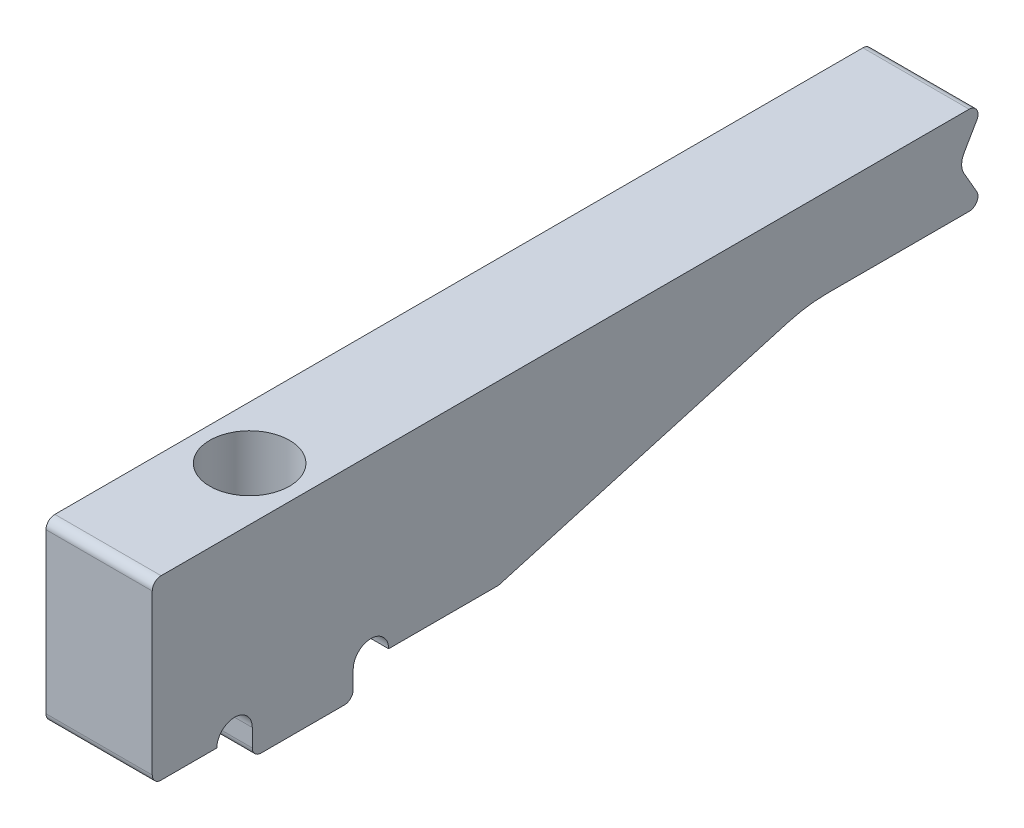
ISO-10303-21;
HEADER;
FILE_DESCRIPTION(('STEP AP214'),'2;1');
FILE_NAME('part.step','',(''),(''),'','','');
FILE_SCHEMA(('AUTOMOTIVE_DESIGN { 1 0 10303 214 1 1 1 1 }'));
ENDSEC;
DATA;
#1=APPLICATION_CONTEXT('core data for automotive mechanical design processes');
#2=APPLICATION_PROTOCOL_DEFINITION('international standard','automotive_design',2000,#1);
#3=PRODUCT_CONTEXT('',#1,'mechanical');
#4=PRODUCT('Part','Part','',(#3));
#5=PRODUCT_RELATED_PRODUCT_CATEGORY('part','',(#4));
#6=PRODUCT_DEFINITION_FORMATION('','',#4);
#7=PRODUCT_DEFINITION_CONTEXT('part definition',#1,'design');
#8=PRODUCT_DEFINITION('design','',#6,#7);
#9=PRODUCT_DEFINITION_SHAPE('','',#8);
#10=(LENGTH_UNIT() NAMED_UNIT(*) SI_UNIT(.MILLI.,.METRE.));
#11=(NAMED_UNIT(*) PLANE_ANGLE_UNIT() SI_UNIT($,.RADIAN.));
#12=(NAMED_UNIT(*) SI_UNIT($,.STERADIAN.) SOLID_ANGLE_UNIT());
#13=UNCERTAINTY_MEASURE_WITH_UNIT(LENGTH_MEASURE(1.E-05),#10,'distance_accuracy_value','');
#14=(GEOMETRIC_REPRESENTATION_CONTEXT(3) GLOBAL_UNCERTAINTY_ASSIGNED_CONTEXT((#13)) GLOBAL_UNIT_ASSIGNED_CONTEXT((#10,
#11,#12)) REPRESENTATION_CONTEXT('',''));
#15=CARTESIAN_POINT('',(0.,0.,0.));
#16=DIRECTION('',(0.,0.,1.));
#17=DIRECTION('',(1.,0.,0.));
#18=AXIS2_PLACEMENT_3D('',#15,#16,#17);
#19=CARTESIAN_POINT('',(0.,-7.5,0.));
#20=DIRECTION('',(0.,-1.,0.));
#21=DIRECTION('',(0.,0.,-1.));
#22=AXIS2_PLACEMENT_3D('',#19,#20,#21);
#23=PLANE('',#22);
#24=DIRECTION('',(0.,0.,-1.));
#25=VECTOR('',#24,1.);
#26=CARTESIAN_POINT('',(-3.,-7.5,8.5));
#27=LINE('',#26,#25);
#28=CARTESIAN_POINT('',(-3.,-7.5,-4.85));
#29=VERTEX_POINT('',#28);
#30=CARTESIAN_POINT('',(-3.,-7.5,-10.9926573634448));
#31=VERTEX_POINT('',#30);
#32=EDGE_CURVE('E206',#29,#31,#27,.T.);
#33=ORIENTED_EDGE('',*,*,#32,.T.);
#34=DIRECTION('',(-1.,0.,0.));
#35=VECTOR('',#34,1.);
#36=CARTESIAN_POINT('',(3.,-7.5,-10.9926573634448));
#37=LINE('',#36,#35);
#38=CARTESIAN_POINT('',(3.,-7.5,-10.9926573634448));
#39=VERTEX_POINT('',#38);
#40=EDGE_CURVE('E317',#31,#39,#37,.F.);
#41=ORIENTED_EDGE('',*,*,#40,.T.);
#42=DIRECTION('',(0.,0.,1.));
#43=VECTOR('',#42,1.);
#44=CARTESIAN_POINT('',(3.,-7.5,8.5));
#45=LINE('',#44,#43);
#46=CARTESIAN_POINT('',(3.,-7.5,-4.85));
#47=VERTEX_POINT('',#46);
#48=EDGE_CURVE('E272',#39,#47,#45,.T.);
#49=ORIENTED_EDGE('',*,*,#48,.T.);
#50=DIRECTION('',(1.,0.,0.));
#51=VECTOR('',#50,1.);
#52=CARTESIAN_POINT('',(-3.,-7.5,-4.85));
#53=LINE('',#52,#51);
#54=EDGE_CURVE('E228',#29,#47,#53,.T.);
#55=ORIENTED_EDGE('',*,*,#54,.F.);
#56=EDGE_LOOP('',(#33,#41,#49,#55));
#57=FACE_BOUND('',#56,.T.);
#58=ADVANCED_FACE('F45',(#57),#23,.T.);
#59=CARTESIAN_POINT('',(-3.,-2.5,8.5));
#60=DIRECTION('',(0.,1.,0.));
#61=DIRECTION('',(0.,0.,1.));
#62=AXIS2_PLACEMENT_3D('',#59,#60,#61);
#63=PLANE('',#62);
#64=DIRECTION('',(0.,0.,-1.));
#65=VECTOR('',#64,1.);
#66=CARTESIAN_POINT('',(3.,-2.5,8.5));
#67=LINE('',#66,#65);
#68=CARTESIAN_POINT('',(3.,-2.5,-29.6243266776192));
#69=VERTEX_POINT('',#68);
#70=CARTESIAN_POINT('',(3.,-2.5,-37.6339745962156));
#71=VERTEX_POINT('',#70);
#72=EDGE_CURVE('E297',#69,#71,#67,.T.);
#73=ORIENTED_EDGE('',*,*,#72,.F.);
#74=DIRECTION('',(1.,0.,0.));
#75=VECTOR('',#74,1.);
#76=CARTESIAN_POINT('',(-3.,-2.5,-29.6243266776192));
#77=LINE('',#76,#75);
#78=CARTESIAN_POINT('',(-3.,-2.5,-29.6243266776192));
#79=VERTEX_POINT('',#78);
#80=EDGE_CURVE('E423',#69,#79,#77,.F.);
#81=ORIENTED_EDGE('',*,*,#80,.T.);
#82=DIRECTION('',(0.,0.,-1.));
#83=VECTOR('',#82,1.);
#84=CARTESIAN_POINT('',(-3.,-2.5,8.5));
#85=LINE('',#84,#83);
#86=CARTESIAN_POINT('',(-3.,-2.5,-37.6339745962156));
#87=VERTEX_POINT('',#86);
#88=EDGE_CURVE('E300',#79,#87,#85,.T.);
#89=ORIENTED_EDGE('',*,*,#88,.T.);
#90=DIRECTION('',(1.,0.,0.));
#91=VECTOR('',#90,1.);
#92=CARTESIAN_POINT('',(-3.,-2.5,-37.6339745962156));
#93=LINE('',#92,#91);
#94=EDGE_CURVE('E388',#87,#71,#93,.T.);
#95=ORIENTED_EDGE('',*,*,#94,.T.);
#96=EDGE_LOOP('',(#73,#81,#89,#95));
#97=FACE_BOUND('',#96,.T.);
#98=ADVANCED_FACE('F451',(#97),#63,.F.);
#99=CARTESIAN_POINT('',(3.,-2.5,8.5));
#100=DIRECTION('',(-1.,0.,0.));
#101=DIRECTION('',(0.,0.,1.));
#102=AXIS2_PLACEMENT_3D('',#99,#100,#101);
#103=PLANE('',#102);
#104=ORIENTED_EDGE('',*,*,#48,.F.);
#105=CARTESIAN_POINT('',(3.,-7.,-10.9926573634448));
#106=DIRECTION('',(-1.,0.,0.));
#107=DIRECTION('',(0.,0.,1.));
#108=AXIS2_PLACEMENT_3D('',#105,#106,#107);
#109=CIRCLE('',#108,0.5);
#110=CARTESIAN_POINT('',(3.,-7.48063084796916,-11.1304760413533));
#111=VERTEX_POINT('',#110);
#112=EDGE_CURVE('E340',#39,#111,#109,.F.);
#113=ORIENTED_EDGE('',*,*,#112,.T.);
#114=DIRECTION('',(0.,-0.275637355817006,0.961261695938317));
#115=VECTOR('',#114,1.);
#116=CARTESIAN_POINT('',(3.,-12.3035063883145,5.68888977889373));
#117=LINE('',#116,#115);
#118=CARTESIAN_POINT('',(3.,-2.80990643249347,-27.4192278310832));
#119=VERTEX_POINT('',#118);
#120=EDGE_CURVE('E311',#111,#119,#117,.F.);
#121=ORIENTED_EDGE('',*,*,#120,.T.);
#122=CARTESIAN_POINT('',(3.,-10.5,-29.6243266776192));
#123=DIRECTION('',(-1.,0.,0.));
#124=DIRECTION('',(0.,0.,1.));
#125=AXIS2_PLACEMENT_3D('',#122,#123,#124);
#126=CIRCLE('',#125,8.);
#127=EDGE_CURVE('E11',#119,#69,#126,.T.);
#128=ORIENTED_EDGE('',*,*,#127,.T.);
#129=ORIENTED_EDGE('',*,*,#72,.T.);
#130=CARTESIAN_POINT('',(3.,-2.,-37.6339745962156));
#131=DIRECTION('',(-1.,0.,0.));
#132=DIRECTION('',(0.,0.,1.));
#133=AXIS2_PLACEMENT_3D('',#130,#131,#132);
#134=CIRCLE('',#133,0.5);
#135=CARTESIAN_POINT('',(3.,-1.75,-38.0669872981078));
#136=VERTEX_POINT('',#135);
#137=EDGE_CURVE('E327',#71,#136,#134,.F.);
#138=ORIENTED_EDGE('',*,*,#137,.T.);
#139=DIRECTION('',(0.,-0.866025403784438,-0.500000000000001));
#140=VECTOR('',#139,1.);
#141=CARTESIAN_POINT('',(3.,0.,-37.0566243270259));
#142=LINE('',#141,#140);
#143=CARTESIAN_POINT('',(3.,-0.500000000000003,-37.3452994616207));
#144=VERTEX_POINT('',#143);
#145=EDGE_CURVE('E281',#144,#136,#142,.T.);
#146=ORIENTED_EDGE('',*,*,#145,.F.);
#147=CARTESIAN_POINT('',(3.,0.,-38.2113248654052));
#148=DIRECTION('',(-1.,0.,0.));
#149=DIRECTION('',(0.,0.,1.));
#150=AXIS2_PLACEMENT_3D('',#147,#148,#149);
#151=CIRCLE('',#150,1.);
#152=CARTESIAN_POINT('',(3.,0.500000000000003,-37.3452994616207));
#153=VERTEX_POINT('',#152);
#154=EDGE_CURVE('E417',#144,#153,#151,.T.);
#155=ORIENTED_EDGE('',*,*,#154,.T.);
#156=DIRECTION('',(0.,-0.866025403784438,0.500000000000001));
#157=VECTOR('',#156,1.);
#158=CARTESIAN_POINT('',(3.,2.5,-38.5));
#159=LINE('',#158,#157);
#160=CARTESIAN_POINT('',(3.,1.75,-38.0669872981078));
#161=VERTEX_POINT('',#160);
#162=EDGE_CURVE('E275',#161,#153,#159,.T.);
#163=ORIENTED_EDGE('',*,*,#162,.F.);
#164=CARTESIAN_POINT('',(3.,2.,-37.6339745962156));
#165=DIRECTION('',(-1.,0.,0.));
#166=DIRECTION('',(0.,0.,1.));
#167=AXIS2_PLACEMENT_3D('',#164,#165,#166);
#168=CIRCLE('',#167,0.5);
#169=CARTESIAN_POINT('',(3.,2.5,-37.6339745962156));
#170=VERTEX_POINT('',#169);
#171=EDGE_CURVE('E331',#161,#170,#168,.F.);
#172=ORIENTED_EDGE('',*,*,#171,.T.);
#173=DIRECTION('',(0.,0.,-1.));
#174=VECTOR('',#173,1.);
#175=CARTESIAN_POINT('',(3.,2.5,8.5));
#176=LINE('',#175,#174);
#177=CARTESIAN_POINT('',(3.,2.5,8.));
#178=VERTEX_POINT('',#177);
#179=EDGE_CURVE('E307',#178,#170,#176,.T.);
#180=ORIENTED_EDGE('',*,*,#179,.F.);
#181=CARTESIAN_POINT('',(3.,2.,8.));
#182=DIRECTION('',(-1.,0.,0.));
#183=DIRECTION('',(0.,0.,1.));
#184=AXIS2_PLACEMENT_3D('',#181,#182,#183);
#185=CIRCLE('',#184,0.5);
#186=CARTESIAN_POINT('',(3.,2.,8.5));
#187=VERTEX_POINT('',#186);
#188=EDGE_CURVE('E334',#178,#187,#185,.F.);
#189=ORIENTED_EDGE('',*,*,#188,.T.);
#190=DIRECTION('',(0.,1.,0.));
#191=VECTOR('',#190,1.);
#192=CARTESIAN_POINT('',(3.,-2.5,8.5));
#193=LINE('',#192,#191);
#194=CARTESIAN_POINT('',(3.,-7.,8.5));
#195=VERTEX_POINT('',#194);
#196=EDGE_CURVE('E284',#195,#187,#193,.T.);
#197=ORIENTED_EDGE('',*,*,#196,.F.);
#198=CARTESIAN_POINT('',(3.,-7.,8.));
#199=DIRECTION('',(-1.,0.,0.));
#200=DIRECTION('',(0.,0.,1.));
#201=AXIS2_PLACEMENT_3D('',#198,#199,#200);
#202=CIRCLE('',#201,0.5);
#203=CARTESIAN_POINT('',(3.,-7.5,8.));
#204=VERTEX_POINT('',#203);
#205=EDGE_CURVE('E337',#195,#204,#202,.F.);
#206=ORIENTED_EDGE('',*,*,#205,.T.);
#207=CARTESIAN_POINT('',(3.,-7.5,4.85));
#208=VERTEX_POINT('',#207);
#209=EDGE_CURVE('E205',#208,#204,#45,.T.);
#210=ORIENTED_EDGE('',*,*,#209,.F.);
#211=CARTESIAN_POINT('',(3.,-7.5,3.85));
#212=DIRECTION('',(1.,0.,0.));
#213=DIRECTION('',(0.,0.,1.));
#214=AXIS2_PLACEMENT_3D('',#211,#212,#213);
#215=CIRCLE('',#214,1.);
#216=CARTESIAN_POINT('',(3.,-7.5,2.85));
#217=VERTEX_POINT('',#216);
#218=EDGE_CURVE('E215',#217,#208,#215,.T.);
#219=ORIENTED_EDGE('',*,*,#218,.F.);
#220=DIRECTION('',(0.,1.,0.));
#221=VECTOR('',#220,1.);
#222=CARTESIAN_POINT('',(3.,-9.,2.85));
#223=LINE('',#222,#221);
#224=CARTESIAN_POINT('',(3.,-8.5,2.85));
#225=VERTEX_POINT('',#224);
#226=EDGE_CURVE('E261',#225,#217,#223,.T.);
#227=ORIENTED_EDGE('',*,*,#226,.F.);
#228=CARTESIAN_POINT('',(3.,-8.5,2.35));
#229=DIRECTION('',(-1.,0.,0.));
#230=DIRECTION('',(0.,0.,1.));
#231=AXIS2_PLACEMENT_3D('',#228,#229,#230);
#232=CIRCLE('',#231,0.5);
#233=CARTESIAN_POINT('',(3.,-9.,2.35));
#234=VERTEX_POINT('',#233);
#235=EDGE_CURVE('E321',#225,#234,#232,.F.);
#236=ORIENTED_EDGE('',*,*,#235,.T.);
#237=DIRECTION('',(0.,0.,1.));
#238=VECTOR('',#237,1.);
#239=CARTESIAN_POINT('',(3.,-9.,-2.85));
#240=LINE('',#239,#238);
#241=CARTESIAN_POINT('',(3.,-9.,-2.35));
#242=VERTEX_POINT('',#241);
#243=EDGE_CURVE('E239',#242,#234,#240,.T.);
#244=ORIENTED_EDGE('',*,*,#243,.F.);
#245=CARTESIAN_POINT('',(3.,-8.5,-2.35));
#246=DIRECTION('',(-1.,0.,0.));
#247=DIRECTION('',(0.,0.,1.));
#248=AXIS2_PLACEMENT_3D('',#245,#246,#247);
#249=CIRCLE('',#248,0.5);
#250=CARTESIAN_POINT('',(3.,-8.5,-2.85));
#251=VERTEX_POINT('',#250);
#252=EDGE_CURVE('E324',#242,#251,#249,.F.);
#253=ORIENTED_EDGE('',*,*,#252,.T.);
#254=DIRECTION('',(0.,1.,0.));
#255=VECTOR('',#254,1.);
#256=CARTESIAN_POINT('',(3.,-9.,-2.85));
#257=LINE('',#256,#255);
#258=CARTESIAN_POINT('',(3.,-7.5,-2.85));
#259=VERTEX_POINT('',#258);
#260=EDGE_CURVE('E248',#251,#259,#257,.T.);
#261=ORIENTED_EDGE('',*,*,#260,.T.);
#262=CARTESIAN_POINT('',(3.,-7.5,-3.85));
#263=DIRECTION('',(1.,0.,0.));
#264=DIRECTION('',(0.,0.,-1.));
#265=AXIS2_PLACEMENT_3D('',#262,#263,#264);
#266=CIRCLE('',#265,1.);
#267=EDGE_CURVE('E225',#47,#259,#266,.T.);
#268=ORIENTED_EDGE('',*,*,#267,.F.);
#269=EDGE_LOOP('',(#104,#113,#121,#128,#129,#138,#146,#155,#163,#172,#180,#189,#197,#206,#210,
#219,#227,#236,#244,#253,#261,#268));
#270=FACE_BOUND('',#269,.T.);
#271=ADVANCED_FACE('F442',(#270),#103,.F.);
#272=CARTESIAN_POINT('',(-3.,2.5,8.5));
#273=DIRECTION('',(0.,-1.,0.));
#274=DIRECTION('',(0.,0.,-1.));
#275=AXIS2_PLACEMENT_3D('',#272,#273,#274);
#276=PLANE('',#275);
#277=CARTESIAN_POINT('',(0.,2.5,0.));
#278=DIRECTION('',(0.,1.,0.));
#279=DIRECTION('',(0.,0.,1.));
#280=AXIS2_PLACEMENT_3D('',#277,#278,#279);
#281=CIRCLE('',#280,2.25);
#282=CARTESIAN_POINT('',(0.,2.5,2.25));
#283=VERTEX_POINT('',#282);
#284=EDGE_CURVE('E264',#283,#283,#281,.T.);
#285=ORIENTED_EDGE('',*,*,#284,.F.);
#286=EDGE_LOOP('',(#285));
#287=FACE_BOUND('',#286,.T.);
#288=DIRECTION('',(0.,0.,-1.));
#289=VECTOR('',#288,1.);
#290=CARTESIAN_POINT('',(-3.,2.5,8.5));
#291=LINE('',#290,#289);
#292=CARTESIAN_POINT('',(-3.,2.5,8.));
#293=VERTEX_POINT('',#292);
#294=CARTESIAN_POINT('',(-3.,2.5,-37.6339745962156));
#295=VERTEX_POINT('',#294);
#296=EDGE_CURVE('E303',#293,#295,#291,.T.);
#297=ORIENTED_EDGE('',*,*,#296,.F.);
#298=DIRECTION('',(-1.,0.,0.));
#299=VECTOR('',#298,1.);
#300=CARTESIAN_POINT('',(-3.,2.5,8.));
#301=LINE('',#300,#299);
#302=EDGE_CURVE('E382',#293,#178,#301,.F.);
#303=ORIENTED_EDGE('',*,*,#302,.T.);
#304=ORIENTED_EDGE('',*,*,#179,.T.);
#305=DIRECTION('',(-1.,0.,0.));
#306=VECTOR('',#305,1.);
#307=CARTESIAN_POINT('',(-3.,2.5,-37.6339745962156));
#308=LINE('',#307,#306);
#309=EDGE_CURVE('E378',#170,#295,#308,.T.);
#310=ORIENTED_EDGE('',*,*,#309,.T.);
#311=EDGE_LOOP('',(#297,#303,#304,#310));
#312=FACE_BOUND('',#311,.T.);
#313=ADVANCED_FACE('F477',(#287,#312),#276,.F.);
#314=CARTESIAN_POINT('',(-3.,-2.5,8.5));
#315=DIRECTION('',(1.,0.,0.));
#316=DIRECTION('',(0.,0.,-1.));
#317=AXIS2_PLACEMENT_3D('',#314,#315,#316);
#318=PLANE('',#317);
#319=ORIENTED_EDGE('',*,*,#88,.F.);
#320=CARTESIAN_POINT('',(-3.,-10.5,-29.6243266776192));
#321=DIRECTION('',(1.,0.,0.));
#322=DIRECTION('',(0.,0.,-1.));
#323=AXIS2_PLACEMENT_3D('',#320,#321,#322);
#324=CIRCLE('',#323,8.);
#325=CARTESIAN_POINT('',(-3.,-2.80990643249347,-27.4192278310832));
#326=VERTEX_POINT('',#325);
#327=EDGE_CURVE('E54',#79,#326,#324,.T.);
#328=ORIENTED_EDGE('',*,*,#327,.T.);
#329=DIRECTION('',(0.,0.275637355817006,-0.961261695938317));
#330=VECTOR('',#329,1.);
#331=CARTESIAN_POINT('',(-3.,-12.3035063883145,5.68888977889373));
#332=LINE('',#331,#330);
#333=CARTESIAN_POINT('',(-3.,-7.48063084796916,-11.1304760413533));
#334=VERTEX_POINT('',#333);
#335=EDGE_CURVE('E314',#326,#334,#332,.F.);
#336=ORIENTED_EDGE('',*,*,#335,.T.);
#337=CARTESIAN_POINT('',(-3.,-7.,-10.9926573634448));
#338=DIRECTION('',(1.,0.,0.));
#339=DIRECTION('',(0.,0.,-1.));
#340=AXIS2_PLACEMENT_3D('',#337,#338,#339);
#341=CIRCLE('',#340,0.5);
#342=EDGE_CURVE('E366',#334,#31,#341,.F.);
#343=ORIENTED_EDGE('',*,*,#342,.T.);
#344=ORIENTED_EDGE('',*,*,#32,.F.);
#345=CARTESIAN_POINT('',(-3.,-7.5,-3.85));
#346=DIRECTION('',(1.,0.,0.));
#347=DIRECTION('',(0.,0.,-1.));
#348=AXIS2_PLACEMENT_3D('',#345,#346,#347);
#349=CIRCLE('',#348,1.);
#350=CARTESIAN_POINT('',(-3.,-7.5,-2.85));
#351=VERTEX_POINT('',#350);
#352=EDGE_CURVE('E232',#29,#351,#349,.T.);
#353=ORIENTED_EDGE('',*,*,#352,.T.);
#354=DIRECTION('',(0.,1.,0.));
#355=VECTOR('',#354,1.);
#356=CARTESIAN_POINT('',(-3.,-9.,-2.85));
#357=LINE('',#356,#355);
#358=CARTESIAN_POINT('',(-3.,-8.5,-2.85));
#359=VERTEX_POINT('',#358);
#360=EDGE_CURVE('E256',#359,#351,#357,.T.);
#361=ORIENTED_EDGE('',*,*,#360,.F.);
#362=CARTESIAN_POINT('',(-3.,-8.5,-2.35));
#363=DIRECTION('',(1.,0.,0.));
#364=DIRECTION('',(0.,0.,-1.));
#365=AXIS2_PLACEMENT_3D('',#362,#363,#364);
#366=CIRCLE('',#365,0.5);
#367=CARTESIAN_POINT('',(-3.,-9.,-2.35));
#368=VERTEX_POINT('',#367);
#369=EDGE_CURVE('E350',#359,#368,#366,.F.);
#370=ORIENTED_EDGE('',*,*,#369,.T.);
#371=DIRECTION('',(0.,0.,-1.));
#372=VECTOR('',#371,1.);
#373=CARTESIAN_POINT('',(-3.,-9.,-2.85));
#374=LINE('',#373,#372);
#375=CARTESIAN_POINT('',(-3.,-9.,2.35));
#376=VERTEX_POINT('',#375);
#377=EDGE_CURVE('E243',#376,#368,#374,.T.);
#378=ORIENTED_EDGE('',*,*,#377,.F.);
#379=CARTESIAN_POINT('',(-3.,-8.5,2.35));
#380=DIRECTION('',(1.,0.,0.));
#381=DIRECTION('',(0.,0.,-1.));
#382=AXIS2_PLACEMENT_3D('',#379,#380,#381);
#383=CIRCLE('',#382,0.5);
#384=CARTESIAN_POINT('',(-3.,-8.5,2.85));
#385=VERTEX_POINT('',#384);
#386=EDGE_CURVE('E347',#376,#385,#383,.F.);
#387=ORIENTED_EDGE('',*,*,#386,.T.);
#388=DIRECTION('',(0.,1.,0.));
#389=VECTOR('',#388,1.);
#390=CARTESIAN_POINT('',(-3.,-9.,2.85));
#391=LINE('',#390,#389);
#392=CARTESIAN_POINT('',(-3.,-7.5,2.85));
#393=VERTEX_POINT('',#392);
#394=EDGE_CURVE('E221',#385,#393,#391,.T.);
#395=ORIENTED_EDGE('',*,*,#394,.T.);
#396=CARTESIAN_POINT('',(-3.,-7.5,3.85));
#397=DIRECTION('',(1.,0.,0.));
#398=DIRECTION('',(0.,0.,1.));
#399=AXIS2_PLACEMENT_3D('',#396,#397,#398);
#400=CIRCLE('',#399,1.);
#401=CARTESIAN_POINT('',(-3.,-7.5,4.85));
#402=VERTEX_POINT('',#401);
#403=EDGE_CURVE('E212',#393,#402,#400,.T.);
#404=ORIENTED_EDGE('',*,*,#403,.T.);
#405=CARTESIAN_POINT('',(-3.,-7.5,8.));
#406=VERTEX_POINT('',#405);
#407=EDGE_CURVE('E195',#406,#402,#27,.T.);
#408=ORIENTED_EDGE('',*,*,#407,.F.);
#409=CARTESIAN_POINT('',(-3.,-7.,8.));
#410=DIRECTION('',(1.,0.,0.));
#411=DIRECTION('',(0.,0.,-1.));
#412=AXIS2_PLACEMENT_3D('',#409,#410,#411);
#413=CIRCLE('',#412,0.5);
#414=CARTESIAN_POINT('',(-3.,-7.,8.5));
#415=VERTEX_POINT('',#414);
#416=EDGE_CURVE('E363',#406,#415,#413,.F.);
#417=ORIENTED_EDGE('',*,*,#416,.T.);
#418=DIRECTION('',(0.,-1.,0.));
#419=VECTOR('',#418,1.);
#420=CARTESIAN_POINT('',(-3.,-2.5,8.5));
#421=LINE('',#420,#419);
#422=CARTESIAN_POINT('',(-3.,2.,8.5));
#423=VERTEX_POINT('',#422);
#424=EDGE_CURVE('E293',#423,#415,#421,.T.);
#425=ORIENTED_EDGE('',*,*,#424,.F.);
#426=CARTESIAN_POINT('',(-3.,2.,8.));
#427=DIRECTION('',(1.,0.,0.));
#428=DIRECTION('',(0.,0.,-1.));
#429=AXIS2_PLACEMENT_3D('',#426,#427,#428);
#430=CIRCLE('',#429,0.5);
#431=EDGE_CURVE('E360',#423,#293,#430,.F.);
#432=ORIENTED_EDGE('',*,*,#431,.T.);
#433=ORIENTED_EDGE('',*,*,#296,.T.);
#434=CARTESIAN_POINT('',(-3.,2.,-37.6339745962156));
#435=DIRECTION('',(1.,0.,0.));
#436=DIRECTION('',(0.,0.,-1.));
#437=AXIS2_PLACEMENT_3D('',#434,#435,#436);
#438=CIRCLE('',#437,0.5);
#439=CARTESIAN_POINT('',(-3.,1.75,-38.0669872981078));
#440=VERTEX_POINT('',#439);
#441=EDGE_CURVE('E357',#295,#440,#438,.F.);
#442=ORIENTED_EDGE('',*,*,#441,.T.);
#443=DIRECTION('',(0.,-0.866025403784438,0.500000000000001));
#444=VECTOR('',#443,1.);
#445=CARTESIAN_POINT('',(-3.,2.5,-38.5));
#446=LINE('',#445,#444);
#447=CARTESIAN_POINT('',(-3.,0.500000000000003,-37.3452994616207));
#448=VERTEX_POINT('',#447);
#449=EDGE_CURVE('E276',#440,#448,#446,.T.);
#450=ORIENTED_EDGE('',*,*,#449,.T.);
#451=CARTESIAN_POINT('',(-3.,0.,-38.2113248654052));
#452=DIRECTION('',(1.,0.,0.));
#453=DIRECTION('',(0.,0.,-1.));
#454=AXIS2_PLACEMENT_3D('',#451,#452,#453);
#455=CIRCLE('',#454,1.);
#456=CARTESIAN_POINT('',(-3.,-0.500000000000003,-37.3452994616207));
#457=VERTEX_POINT('',#456);
#458=EDGE_CURVE('E420',#448,#457,#455,.T.);
#459=ORIENTED_EDGE('',*,*,#458,.T.);
#460=DIRECTION('',(0.,-0.866025403784438,-0.500000000000001));
#461=VECTOR('',#460,1.);
#462=CARTESIAN_POINT('',(-3.,0.,-37.0566243270259));
#463=LINE('',#462,#461);
#464=CARTESIAN_POINT('',(-3.,-1.75,-38.0669872981078));
#465=VERTEX_POINT('',#464);
#466=EDGE_CURVE('E280',#457,#465,#463,.T.);
#467=ORIENTED_EDGE('',*,*,#466,.T.);
#468=CARTESIAN_POINT('',(-3.,-2.,-37.6339745962156));
#469=DIRECTION('',(1.,0.,0.));
#470=DIRECTION('',(0.,0.,-1.));
#471=AXIS2_PLACEMENT_3D('',#468,#469,#470);
#472=CIRCLE('',#471,0.5);
#473=EDGE_CURVE('E353',#465,#87,#472,.F.);
#474=ORIENTED_EDGE('',*,*,#473,.T.);
#475=EDGE_LOOP('',(#319,#328,#336,#343,#344,#353,#361,#370,#378,#387,#395,#404,#408,#417,#425,
#432,#433,#442,#450,#459,#467,#474));
#476=FACE_BOUND('',#475,.T.);
#477=ADVANCED_FACE('F219',(#476),#318,.F.);
#478=CARTESIAN_POINT('',(0.,0.,8.5));
#479=DIRECTION('',(0.,0.,-1.));
#480=DIRECTION('',(-1.,0.,0.));
#481=AXIS2_PLACEMENT_3D('',#478,#479,#480);
#482=PLANE('',#481);
#483=ORIENTED_EDGE('',*,*,#424,.T.);
#484=DIRECTION('',(-1.,0.,0.));
#485=VECTOR('',#484,1.);
#486=CARTESIAN_POINT('',(3.,-7.,8.5));
#487=LINE('',#486,#485);
#488=EDGE_CURVE('E375',#415,#195,#487,.F.);
#489=ORIENTED_EDGE('',*,*,#488,.T.);
#490=ORIENTED_EDGE('',*,*,#196,.T.);
#491=DIRECTION('',(-1.,0.,0.));
#492=VECTOR('',#491,1.);
#493=CARTESIAN_POINT('',(0.,2.,8.5));
#494=LINE('',#493,#492);
#495=EDGE_CURVE('E371',#187,#423,#494,.T.);
#496=ORIENTED_EDGE('',*,*,#495,.T.);
#497=EDGE_LOOP('',(#483,#489,#490,#496));
#498=FACE_BOUND('',#497,.T.);
#499=ADVANCED_FACE('F487',(#498),#482,.F.);
#500=CARTESIAN_POINT('',(-3.,0.,-37.0566243270259));
#501=DIRECTION('',(0.,-0.500000000000001,0.866025403784438));
#502=DIRECTION('',(0.,-0.866025403784438,-0.500000000000001));
#503=AXIS2_PLACEMENT_3D('',#500,#501,#502);
#504=PLANE('',#503);
#505=ORIENTED_EDGE('',*,*,#466,.F.);
#506=DIRECTION('',(1.,0.,0.));
#507=VECTOR('',#506,1.);
#508=CARTESIAN_POINT('',(3.,-0.500000000000002,-37.3452994616207));
#509=LINE('',#508,#507);
#510=EDGE_CURVE('E410',#457,#144,#509,.T.);
#511=ORIENTED_EDGE('',*,*,#510,.T.);
#512=ORIENTED_EDGE('',*,*,#145,.T.);
#513=DIRECTION('',(1.,0.,0.));
#514=VECTOR('',#513,1.);
#515=CARTESIAN_POINT('',(-3.,-1.75,-38.0669872981078));
#516=LINE('',#515,#514);
#517=EDGE_CURVE('E392',#136,#465,#516,.F.);
#518=ORIENTED_EDGE('',*,*,#517,.T.);
#519=EDGE_LOOP('',(#505,#511,#512,#518));
#520=FACE_BOUND('',#519,.T.);
#521=ADVANCED_FACE('F461',(#520),#504,.F.);
#522=CARTESIAN_POINT('',(-3.,2.5,-38.5));
#523=DIRECTION('',(0.,0.500000000000001,0.866025403784438));
#524=DIRECTION('',(0.,-0.866025403784438,0.500000000000001));
#525=AXIS2_PLACEMENT_3D('',#522,#523,#524);
#526=PLANE('',#525);
#527=ORIENTED_EDGE('',*,*,#162,.T.);
#528=DIRECTION('',(1.,0.,0.));
#529=VECTOR('',#528,1.);
#530=CARTESIAN_POINT('',(-3.,0.500000000000002,-37.3452994616207));
#531=LINE('',#530,#529);
#532=EDGE_CURVE('E414',#153,#448,#531,.F.);
#533=ORIENTED_EDGE('',*,*,#532,.T.);
#534=ORIENTED_EDGE('',*,*,#449,.F.);
#535=DIRECTION('',(-1.,0.,0.));
#536=VECTOR('',#535,1.);
#537=CARTESIAN_POINT('',(-3.,1.75,-38.0669872981078));
#538=LINE('',#537,#536);
#539=EDGE_CURVE('E385',#440,#161,#538,.F.);
#540=ORIENTED_EDGE('',*,*,#539,.T.);
#541=EDGE_LOOP('',(#527,#533,#534,#540));
#542=FACE_BOUND('',#541,.T.);
#543=ADVANCED_FACE('F469',(#542),#526,.F.);
#544=ORIENTED_EDGE('',*,*,#209,.T.);
#545=DIRECTION('',(-1.,0.,0.));
#546=VECTOR('',#545,1.);
#547=CARTESIAN_POINT('',(-3.,-7.5,8.));
#548=LINE('',#547,#546);
#549=EDGE_CURVE('E202',#204,#406,#548,.T.);
#550=ORIENTED_EDGE('',*,*,#549,.T.);
#551=ORIENTED_EDGE('',*,*,#407,.T.);
#552=DIRECTION('',(1.,0.,0.));
#553=VECTOR('',#552,1.);
#554=CARTESIAN_POINT('',(-3.,-7.5,4.85));
#555=LINE('',#554,#553);
#556=EDGE_CURVE('E199',#402,#208,#555,.T.);
#557=ORIENTED_EDGE('',*,*,#556,.T.);
#558=EDGE_LOOP('',(#544,#550,#551,#557));
#559=FACE_BOUND('',#558,.T.);
#560=ADVANCED_FACE('F198',(#559),#23,.T.);
#561=CARTESIAN_POINT('',(0.,-7.5,0.));
#562=DIRECTION('',(0.,1.,0.));
#563=DIRECTION('',(0.,0.,1.));
#564=AXIS2_PLACEMENT_3D('',#561,#562,#563);
#565=CYLINDRICAL_SURFACE('',#564,2.25);
#566=CARTESIAN_POINT('',(0.,-7.5,0.));
#567=DIRECTION('',(0.,1.,0.));
#568=DIRECTION('',(0.,0.,1.));
#569=AXIS2_PLACEMENT_3D('',#566,#567,#568);
#570=CIRCLE('',#569,2.25);
#571=CARTESIAN_POINT('',(0.,-7.5,2.25));
#572=VERTEX_POINT('',#571);
#573=EDGE_CURVE('E265',#572,#572,#570,.T.);
#574=ORIENTED_EDGE('',*,*,#573,.F.);
#575=EDGE_LOOP('',(#574));
#576=FACE_BOUND('',#575,.T.);
#577=ORIENTED_EDGE('',*,*,#284,.T.);
#578=EDGE_LOOP('',(#577));
#579=FACE_BOUND('',#578,.T.);
#580=ADVANCED_FACE('F534',(#576,#579),#565,.F.);
#581=CARTESIAN_POINT('',(0.,-9.,0.));
#582=DIRECTION('',(0.,1.,0.));
#583=DIRECTION('',(0.,0.,1.));
#584=AXIS2_PLACEMENT_3D('',#581,#582,#583);
#585=PLANE('',#584);
#586=ORIENTED_EDGE('',*,*,#377,.T.);
#587=DIRECTION('',(1.,0.,0.));
#588=VECTOR('',#587,1.);
#589=CARTESIAN_POINT('',(0.,-9.,-2.35));
#590=LINE('',#589,#588);
#591=EDGE_CURVE('E400',#368,#242,#590,.T.);
#592=ORIENTED_EDGE('',*,*,#591,.T.);
#593=ORIENTED_EDGE('',*,*,#243,.T.);
#594=DIRECTION('',(-1.,0.,0.));
#595=VECTOR('',#594,1.);
#596=CARTESIAN_POINT('',(0.,-9.,2.35));
#597=LINE('',#596,#595);
#598=EDGE_CURVE('E396',#234,#376,#597,.T.);
#599=ORIENTED_EDGE('',*,*,#598,.T.);
#600=EDGE_LOOP('',(#586,#592,#593,#599));
#601=FACE_BOUND('',#600,.T.);
#602=ADVANCED_FACE('F502',(#601),#585,.F.);
#603=CARTESIAN_POINT('',(-3.,-9.,-2.85));
#604=DIRECTION('',(0.,0.,1.));
#605=DIRECTION('',(1.,0.,0.));
#606=AXIS2_PLACEMENT_3D('',#603,#604,#605);
#607=PLANE('',#606);
#608=ORIENTED_EDGE('',*,*,#260,.F.);
#609=DIRECTION('',(1.,0.,0.));
#610=VECTOR('',#609,1.);
#611=CARTESIAN_POINT('',(-3.,-8.5,-2.85));
#612=LINE('',#611,#610);
#613=EDGE_CURVE('E404',#251,#359,#612,.F.);
#614=ORIENTED_EDGE('',*,*,#613,.T.);
#615=ORIENTED_EDGE('',*,*,#360,.T.);
#616=DIRECTION('',(1.,0.,0.));
#617=VECTOR('',#616,1.);
#618=CARTESIAN_POINT('',(-3.,-7.5,-2.85));
#619=LINE('',#618,#617);
#620=EDGE_CURVE('E244',#351,#259,#619,.T.);
#621=ORIENTED_EDGE('',*,*,#620,.T.);
#622=EDGE_LOOP('',(#608,#614,#615,#621));
#623=FACE_BOUND('',#622,.T.);
#624=ADVANCED_FACE('F511',(#623),#607,.F.);
#625=CARTESIAN_POINT('',(-3.,-9.,2.85));
#626=DIRECTION('',(0.,0.,-1.));
#627=DIRECTION('',(-1.,0.,0.));
#628=AXIS2_PLACEMENT_3D('',#625,#626,#627);
#629=PLANE('',#628);
#630=ORIENTED_EDGE('',*,*,#394,.F.);
#631=DIRECTION('',(-1.,0.,0.));
#632=VECTOR('',#631,1.);
#633=CARTESIAN_POINT('',(-3.,-8.5,2.85));
#634=LINE('',#633,#632);
#635=EDGE_CURVE('E407',#385,#225,#634,.F.);
#636=ORIENTED_EDGE('',*,*,#635,.T.);
#637=ORIENTED_EDGE('',*,*,#226,.T.);
#638=DIRECTION('',(-1.,0.,0.));
#639=VECTOR('',#638,1.);
#640=CARTESIAN_POINT('',(-3.,-7.5,2.85));
#641=LINE('',#640,#639);
#642=EDGE_CURVE('E217',#217,#393,#641,.T.);
#643=ORIENTED_EDGE('',*,*,#642,.T.);
#644=EDGE_LOOP('',(#630,#636,#637,#643));
#645=FACE_BOUND('',#644,.T.);
#646=ADVANCED_FACE('F681',(#645),#629,.F.);
#647=CARTESIAN_POINT('',(0.,-7.5,0.));
#648=DIRECTION('',(0.,1.,0.));
#649=DIRECTION('',(0.,0.,1.));
#650=AXIS2_PLACEMENT_3D('',#647,#648,#649);
#651=PLANE('',#650);
#652=ORIENTED_EDGE('',*,*,#573,.T.);
#653=EDGE_LOOP('',(#652));
#654=FACE_BOUND('',#653,.T.);
#655=ADVANCED_FACE('F522',(#654),#651,.T.);
#656=CARTESIAN_POINT('',(-3.,-7.5,3.85));
#657=DIRECTION('',(1.,0.,0.));
#658=DIRECTION('',(0.,0.,-1.));
#659=AXIS2_PLACEMENT_3D('',#656,#657,#658);
#660=CYLINDRICAL_SURFACE('',#659,1.);
#661=ORIENTED_EDGE('',*,*,#218,.T.);
#662=ORIENTED_EDGE('',*,*,#556,.F.);
#663=ORIENTED_EDGE('',*,*,#403,.F.);
#664=ORIENTED_EDGE('',*,*,#642,.F.);
#665=EDGE_LOOP('',(#661,#662,#663,#664));
#666=FACE_BOUND('',#665,.T.);
#667=ADVANCED_FACE('F210',(#666),#660,.F.);
#668=CARTESIAN_POINT('',(-3.,-7.5,-3.85));
#669=DIRECTION('',(1.,0.,0.));
#670=DIRECTION('',(0.,0.,-1.));
#671=AXIS2_PLACEMENT_3D('',#668,#669,#670);
#672=CYLINDRICAL_SURFACE('',#671,1.);
#673=ORIENTED_EDGE('',*,*,#267,.T.);
#674=ORIENTED_EDGE('',*,*,#620,.F.);
#675=ORIENTED_EDGE('',*,*,#352,.F.);
#676=ORIENTED_EDGE('',*,*,#54,.T.);
#677=EDGE_LOOP('',(#673,#674,#675,#676));
#678=FACE_BOUND('',#677,.T.);
#679=ADVANCED_FACE('F514',(#678),#672,.F.);
#680=CARTESIAN_POINT('',(-3.,-8.23490771517633,-8.5));
#681=DIRECTION('',(0.,-0.961261695938317,-0.275637355817006));
#682=DIRECTION('',(-1.,0.,0.));
#683=AXIS2_PLACEMENT_3D('',#680,#681,#682);
#684=PLANE('',#683);
#685=ORIENTED_EDGE('',*,*,#335,.F.);
#686=DIRECTION('',(-1.,0.,0.));
#687=VECTOR('',#686,1.);
#688=CARTESIAN_POINT('',(3.,-2.80990643249346,-27.4192278310832));
#689=LINE('',#688,#687);
#690=EDGE_CURVE('E67',#326,#119,#689,.F.);
#691=ORIENTED_EDGE('',*,*,#690,.T.);
#692=ORIENTED_EDGE('',*,*,#120,.F.);
#693=DIRECTION('',(1.,0.,0.));
#694=VECTOR('',#693,1.);
#695=CARTESIAN_POINT('',(-3.,-7.48063084796916,-11.1304760413533));
#696=LINE('',#695,#694);
#697=EDGE_CURVE('E343',#111,#334,#696,.F.);
#698=ORIENTED_EDGE('',*,*,#697,.T.);
#699=EDGE_LOOP('',(#685,#691,#692,#698));
#700=FACE_BOUND('',#699,.T.);
#701=ADVANCED_FACE('F445',(#700),#684,.T.);
#702=CARTESIAN_POINT('',(0.,-7.,-10.9926573634448));
#703=DIRECTION('',(1.,0.,0.));
#704=DIRECTION('',(0.,0.,-1.));
#705=AXIS2_PLACEMENT_3D('',#702,#703,#704);
#706=CYLINDRICAL_SURFACE('',#705,0.5);
#707=ORIENTED_EDGE('',*,*,#342,.F.);
#708=ORIENTED_EDGE('',*,*,#697,.F.);
#709=ORIENTED_EDGE('',*,*,#112,.F.);
#710=ORIENTED_EDGE('',*,*,#40,.F.);
#711=EDGE_LOOP('',(#707,#708,#709,#710));
#712=FACE_BOUND('',#711,.T.);
#713=ADVANCED_FACE('F439',(#712),#706,.T.);
#714=CARTESIAN_POINT('',(0.,-7.,8.));
#715=DIRECTION('',(1.,0.,0.));
#716=DIRECTION('',(0.,0.,-1.));
#717=AXIS2_PLACEMENT_3D('',#714,#715,#716);
#718=CYLINDRICAL_SURFACE('',#717,0.5);
#719=ORIENTED_EDGE('',*,*,#205,.F.);
#720=ORIENTED_EDGE('',*,*,#488,.F.);
#721=ORIENTED_EDGE('',*,*,#416,.F.);
#722=ORIENTED_EDGE('',*,*,#549,.F.);
#723=EDGE_LOOP('',(#719,#720,#721,#722));
#724=FACE_BOUND('',#723,.T.);
#725=ADVANCED_FACE('F491',(#724),#718,.T.);
#726=CARTESIAN_POINT('',(0.,2.,8.));
#727=DIRECTION('',(-1.,0.,0.));
#728=DIRECTION('',(0.,0.,1.));
#729=AXIS2_PLACEMENT_3D('',#726,#727,#728);
#730=CYLINDRICAL_SURFACE('',#729,0.5);
#731=ORIENTED_EDGE('',*,*,#188,.F.);
#732=ORIENTED_EDGE('',*,*,#302,.F.);
#733=ORIENTED_EDGE('',*,*,#431,.F.);
#734=ORIENTED_EDGE('',*,*,#495,.F.);
#735=EDGE_LOOP('',(#731,#732,#733,#734));
#736=FACE_BOUND('',#735,.T.);
#737=ADVANCED_FACE('F484',(#736),#730,.T.);
#738=CARTESIAN_POINT('',(-3.,2.,-37.6339745962156));
#739=DIRECTION('',(-1.,0.,0.));
#740=DIRECTION('',(0.,0.,1.));
#741=AXIS2_PLACEMENT_3D('',#738,#739,#740);
#742=CYLINDRICAL_SURFACE('',#741,0.5);
#743=ORIENTED_EDGE('',*,*,#171,.F.);
#744=ORIENTED_EDGE('',*,*,#539,.F.);
#745=ORIENTED_EDGE('',*,*,#441,.F.);
#746=ORIENTED_EDGE('',*,*,#309,.F.);
#747=EDGE_LOOP('',(#743,#744,#745,#746));
#748=FACE_BOUND('',#747,.T.);
#749=ADVANCED_FACE('F475',(#748),#742,.T.);
#750=CARTESIAN_POINT('',(-3.,-2.,-37.6339745962156));
#751=DIRECTION('',(1.,0.,0.));
#752=DIRECTION('',(0.,0.,-1.));
#753=AXIS2_PLACEMENT_3D('',#750,#751,#752);
#754=CYLINDRICAL_SURFACE('',#753,0.5);
#755=ORIENTED_EDGE('',*,*,#473,.F.);
#756=ORIENTED_EDGE('',*,*,#517,.F.);
#757=ORIENTED_EDGE('',*,*,#137,.F.);
#758=ORIENTED_EDGE('',*,*,#94,.F.);
#759=EDGE_LOOP('',(#755,#756,#757,#758));
#760=FACE_BOUND('',#759,.T.);
#761=ADVANCED_FACE('F455',(#760),#754,.T.);
#762=CARTESIAN_POINT('',(0.,-8.5,-2.35));
#763=DIRECTION('',(1.,0.,0.));
#764=DIRECTION('',(0.,0.,-1.));
#765=AXIS2_PLACEMENT_3D('',#762,#763,#764);
#766=CYLINDRICAL_SURFACE('',#765,0.5);
#767=ORIENTED_EDGE('',*,*,#369,.F.);
#768=ORIENTED_EDGE('',*,*,#613,.F.);
#769=ORIENTED_EDGE('',*,*,#252,.F.);
#770=ORIENTED_EDGE('',*,*,#591,.F.);
#771=EDGE_LOOP('',(#767,#768,#769,#770));
#772=FACE_BOUND('',#771,.T.);
#773=ADVANCED_FACE('F508',(#772),#766,.T.);
#774=CARTESIAN_POINT('',(0.,-8.5,2.35));
#775=DIRECTION('',(-1.,0.,0.));
#776=DIRECTION('',(0.,0.,1.));
#777=AXIS2_PLACEMENT_3D('',#774,#775,#776);
#778=CYLINDRICAL_SURFACE('',#777,0.5);
#779=ORIENTED_EDGE('',*,*,#235,.F.);
#780=ORIENTED_EDGE('',*,*,#635,.F.);
#781=ORIENTED_EDGE('',*,*,#386,.F.);
#782=ORIENTED_EDGE('',*,*,#598,.F.);
#783=EDGE_LOOP('',(#779,#780,#781,#782));
#784=FACE_BOUND('',#783,.T.);
#785=ADVANCED_FACE('F499',(#784),#778,.T.);
#786=CARTESIAN_POINT('',(-3.,0.,-38.2113248654052));
#787=DIRECTION('',(-1.,0.,0.));
#788=DIRECTION('',(0.,-1.,0.));
#789=AXIS2_PLACEMENT_3D('',#786,#787,#788);
#790=CYLINDRICAL_SURFACE('',#789,1.);
#791=ORIENTED_EDGE('',*,*,#458,.F.);
#792=ORIENTED_EDGE('',*,*,#532,.F.);
#793=ORIENTED_EDGE('',*,*,#154,.F.);
#794=ORIENTED_EDGE('',*,*,#510,.F.);
#795=EDGE_LOOP('',(#791,#792,#793,#794));
#796=FACE_BOUND('',#795,.T.);
#797=ADVANCED_FACE('F465',(#796),#790,.F.);
#798=CARTESIAN_POINT('',(-3.,-10.5,-29.6243266776192));
#799=DIRECTION('',(-1.,0.,0.));
#800=DIRECTION('',(0.,0.,1.));
#801=AXIS2_PLACEMENT_3D('',#798,#799,#800);
#802=CYLINDRICAL_SURFACE('',#801,8.);
#803=ORIENTED_EDGE('',*,*,#127,.F.);
#804=ORIENTED_EDGE('',*,*,#690,.F.);
#805=ORIENTED_EDGE('',*,*,#327,.F.);
#806=ORIENTED_EDGE('',*,*,#80,.F.);
#807=EDGE_LOOP('',(#803,#804,#805,#806));
#808=FACE_BOUND('',#807,.T.);
#809=ADVANCED_FACE('F47',(#808),#802,.F.);
#810=CLOSED_SHELL('',(#58,#98,#271,#313,#477,#499,#521,#543,#560,#580,#602,#624,#646,#655,#667,
#679,#701,#713,#725,#737,#749,#761,#773,#785,#797,#809));
#811=MANIFOLD_SOLID_BREP('B2',#810);
#812=ADVANCED_BREP_SHAPE_REPRESENTATION('',(#18,#811),#14);
#813=SHAPE_DEFINITION_REPRESENTATION(#9,#812);
ENDSEC;
END-ISO-10303-21;
